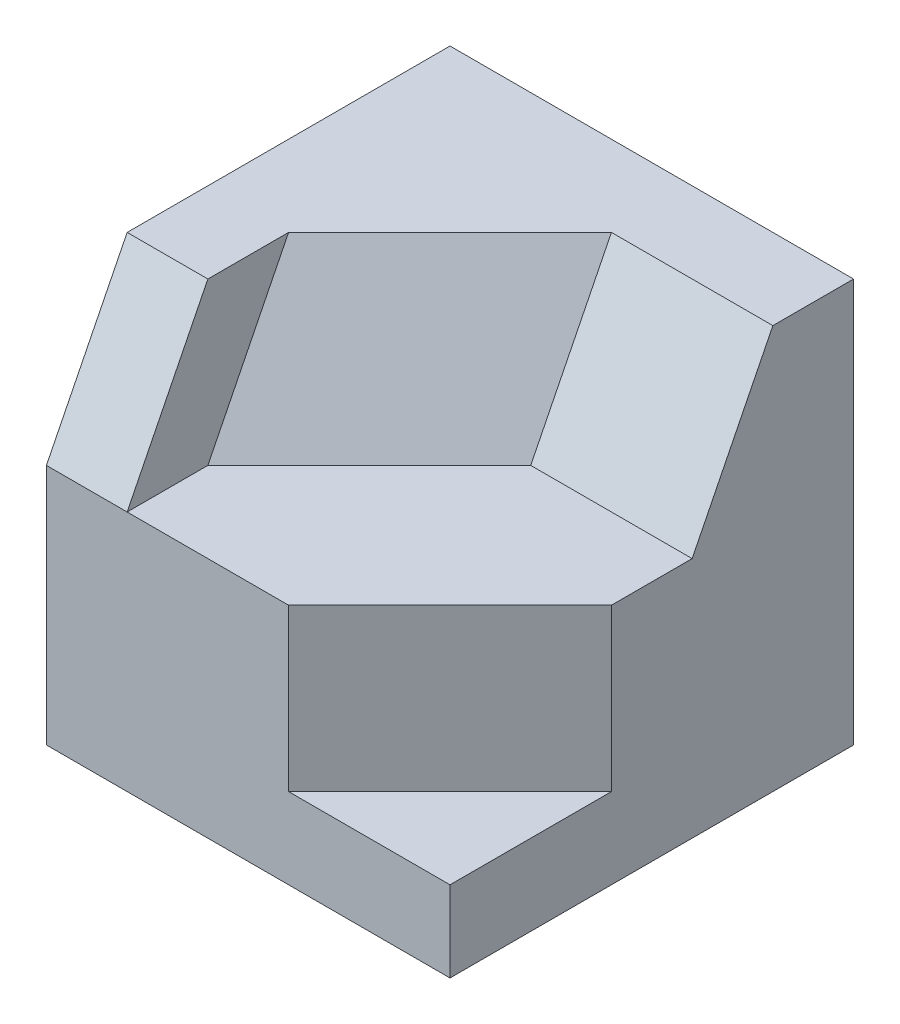
ISO-10303-21;
HEADER;
FILE_DESCRIPTION(('STEP AP214'),'2;1');
FILE_NAME('part.step','',(''),(''),'','','');
FILE_SCHEMA(('AUTOMOTIVE_DESIGN { 1 0 10303 214 1 1 1 1 }'));
ENDSEC;
DATA;
#1=APPLICATION_CONTEXT('core data for automotive mechanical design processes');
#2=APPLICATION_PROTOCOL_DEFINITION('international standard','automotive_design',2000,#1);
#3=PRODUCT_CONTEXT('',#1,'mechanical');
#4=PRODUCT('Part','Part','',(#3));
#5=PRODUCT_RELATED_PRODUCT_CATEGORY('part','',(#4));
#6=PRODUCT_DEFINITION_FORMATION('','',#4);
#7=PRODUCT_DEFINITION_CONTEXT('part definition',#1,'design');
#8=PRODUCT_DEFINITION('design','',#6,#7);
#9=PRODUCT_DEFINITION_SHAPE('','',#8);
#10=(LENGTH_UNIT() NAMED_UNIT(*) SI_UNIT(.MILLI.,.METRE.));
#11=(NAMED_UNIT(*) PLANE_ANGLE_UNIT() SI_UNIT($,.RADIAN.));
#12=(NAMED_UNIT(*) SI_UNIT($,.STERADIAN.) SOLID_ANGLE_UNIT());
#13=UNCERTAINTY_MEASURE_WITH_UNIT(LENGTH_MEASURE(1.E-05),#10,'distance_accuracy_value','');
#14=(GEOMETRIC_REPRESENTATION_CONTEXT(3) GLOBAL_UNCERTAINTY_ASSIGNED_CONTEXT((#13)) GLOBAL_UNIT_ASSIGNED_CONTEXT((#10,
#11,#12)) REPRESENTATION_CONTEXT('',''));
#15=CARTESIAN_POINT('',(0.,0.,0.));
#16=DIRECTION('',(0.,0.,1.));
#17=DIRECTION('',(1.,0.,0.));
#18=AXIS2_PLACEMENT_3D('',#15,#16,#17);
#19=CARTESIAN_POINT('',(2.5,2.5,5.));
#20=DIRECTION('',(0.,-1.,0.));
#21=DIRECTION('',(1.,0.,0.));
#22=AXIS2_PLACEMENT_3D('',#19,#20,#21);
#23=PLANE('',#22);
#24=DIRECTION('',(0.,0.,1.));
#25=VECTOR('',#24,1.);
#26=CARTESIAN_POINT('',(-1.5,2.5,4.));
#27=LINE('',#26,#25);
#28=CARTESIAN_POINT('',(-1.5,2.5,3.));
#29=VERTEX_POINT('',#28);
#30=CARTESIAN_POINT('',(-1.5,2.5,4.));
#31=VERTEX_POINT('',#30);
#32=EDGE_CURVE('E171',#29,#31,#27,.T.);
#33=ORIENTED_EDGE('',*,*,#32,.F.);
#34=DIRECTION('',(-0.707106781186547,0.,0.707106781186548));
#35=VECTOR('',#34,1.);
#36=CARTESIAN_POINT('',(0.750000000000001,2.5,0.75));
#37=LINE('',#36,#35);
#38=CARTESIAN_POINT('',(0.500000000000001,2.5,1.));
#39=VERTEX_POINT('',#38);
#40=EDGE_CURVE('E162',#39,#29,#37,.T.);
#41=ORIENTED_EDGE('',*,*,#40,.F.);
#42=DIRECTION('',(1.,0.,0.));
#43=VECTOR('',#42,1.);
#44=CARTESIAN_POINT('',(0.5,2.5,1.));
#45=LINE('',#44,#43);
#46=CARTESIAN_POINT('',(2.5,2.5,1.));
#47=VERTEX_POINT('',#46);
#48=EDGE_CURVE('E148',#39,#47,#45,.T.);
#49=ORIENTED_EDGE('',*,*,#48,.T.);
#50=DIRECTION('',(0.,0.,-1.));
#51=VECTOR('',#50,1.);
#52=CARTESIAN_POINT('',(2.5,2.5,5.));
#53=LINE('',#52,#51);
#54=CARTESIAN_POINT('',(2.5,2.5,0.));
#55=VERTEX_POINT('',#54);
#56=EDGE_CURVE('E88',#47,#55,#53,.T.);
#57=ORIENTED_EDGE('',*,*,#56,.T.);
#58=DIRECTION('',(-1.,0.,0.));
#59=VECTOR('',#58,1.);
#60=CARTESIAN_POINT('',(2.5,2.5,0.));
#61=LINE('',#60,#59);
#62=CARTESIAN_POINT('',(-2.5,2.5,0.));
#63=VERTEX_POINT('',#62);
#64=EDGE_CURVE('E92',#55,#63,#61,.T.);
#65=ORIENTED_EDGE('',*,*,#64,.T.);
#66=DIRECTION('',(0.,0.,-1.));
#67=VECTOR('',#66,1.);
#68=CARTESIAN_POINT('',(-2.5,2.5,5.));
#69=LINE('',#68,#67);
#70=CARTESIAN_POINT('',(-2.5,2.5,4.));
#71=VERTEX_POINT('',#70);
#72=EDGE_CURVE('E77',#71,#63,#69,.T.);
#73=ORIENTED_EDGE('',*,*,#72,.F.);
#74=DIRECTION('',(-1.,0.,0.));
#75=VECTOR('',#74,1.);
#76=CARTESIAN_POINT('',(-1.5,2.5,4.));
#77=LINE('',#76,#75);
#78=EDGE_CURVE('E134',#31,#71,#77,.T.);
#79=ORIENTED_EDGE('',*,*,#78,.F.);
#80=EDGE_LOOP('',(#33,#41,#49,#57,#65,#73,#79));
#81=FACE_BOUND('',#80,.T.);
#82=ADVANCED_FACE('F33',(#81),#23,.F.);
#83=CARTESIAN_POINT('',(-2.5,-2.5,5.));
#84=DIRECTION('',(1.,0.,0.));
#85=DIRECTION('',(0.,0.,-1.));
#86=AXIS2_PLACEMENT_3D('',#83,#84,#85);
#87=PLANE('',#86);
#88=DIRECTION('',(0.,-1.,0.));
#89=VECTOR('',#88,1.);
#90=CARTESIAN_POINT('',(-2.5,-2.5,5.));
#91=LINE('',#90,#89);
#92=CARTESIAN_POINT('',(-2.5,0.5,5.));
#93=VERTEX_POINT('',#92);
#94=CARTESIAN_POINT('',(-2.5,-2.5,5.));
#95=VERTEX_POINT('',#94);
#96=EDGE_CURVE('E99',#93,#95,#91,.T.);
#97=ORIENTED_EDGE('',*,*,#96,.F.);
#98=DIRECTION('',(0.,-0.894427190999916,0.447213595499958));
#99=VECTOR('',#98,1.);
#100=CARTESIAN_POINT('',(-2.5,2.5,4.));
#101=LINE('',#100,#99);
#102=EDGE_CURVE('E85',#71,#93,#101,.T.);
#103=ORIENTED_EDGE('',*,*,#102,.F.);
#104=ORIENTED_EDGE('',*,*,#72,.T.);
#105=DIRECTION('',(0.,-1.,0.));
#106=VECTOR('',#105,1.);
#107=CARTESIAN_POINT('',(-2.5,-2.5,0.));
#108=LINE('',#107,#106);
#109=CARTESIAN_POINT('',(-2.5,-2.5,0.));
#110=VERTEX_POINT('',#109);
#111=EDGE_CURVE('E82',#63,#110,#108,.T.);
#112=ORIENTED_EDGE('',*,*,#111,.T.);
#113=DIRECTION('',(0.,0.,-1.));
#114=VECTOR('',#113,1.);
#115=CARTESIAN_POINT('',(-2.5,-2.5,5.));
#116=LINE('',#115,#114);
#117=EDGE_CURVE('E41',#95,#110,#116,.T.);
#118=ORIENTED_EDGE('',*,*,#117,.F.);
#119=EDGE_LOOP('',(#97,#103,#104,#112,#118));
#120=FACE_BOUND('',#119,.T.);
#121=ADVANCED_FACE('F35',(#120),#87,.F.);
#122=CARTESIAN_POINT('',(2.5,-2.5,5.));
#123=DIRECTION('',(0.,1.,0.));
#124=DIRECTION('',(0.,0.,1.));
#125=AXIS2_PLACEMENT_3D('',#122,#123,#124);
#126=PLANE('',#125);
#127=DIRECTION('',(1.,0.,0.));
#128=VECTOR('',#127,1.);
#129=CARTESIAN_POINT('',(2.5,-2.5,0.));
#130=LINE('',#129,#128);
#131=CARTESIAN_POINT('',(2.5,-2.5,0.));
#132=VERTEX_POINT('',#131);
#133=EDGE_CURVE('E103',#110,#132,#130,.T.);
#134=ORIENTED_EDGE('',*,*,#133,.T.);
#135=DIRECTION('',(0.,0.,-1.));
#136=VECTOR('',#135,1.);
#137=CARTESIAN_POINT('',(2.5,-2.5,5.));
#138=LINE('',#137,#136);
#139=CARTESIAN_POINT('',(2.5,-2.5,5.));
#140=VERTEX_POINT('',#139);
#141=EDGE_CURVE('E116',#140,#132,#138,.T.);
#142=ORIENTED_EDGE('',*,*,#141,.F.);
#143=DIRECTION('',(1.,0.,0.));
#144=VECTOR('',#143,1.);
#145=CARTESIAN_POINT('',(2.5,-2.5,5.));
#146=LINE('',#145,#144);
#147=EDGE_CURVE('E57',#95,#140,#146,.T.);
#148=ORIENTED_EDGE('',*,*,#147,.F.);
#149=ORIENTED_EDGE('',*,*,#117,.T.);
#150=EDGE_LOOP('',(#134,#142,#148,#149));
#151=FACE_BOUND('',#150,.T.);
#152=ADVANCED_FACE('F119',(#151),#126,.F.);
#153=CARTESIAN_POINT('',(2.5,-2.5,5.));
#154=DIRECTION('',(-1.,0.,0.));
#155=DIRECTION('',(0.,0.,1.));
#156=AXIS2_PLACEMENT_3D('',#153,#154,#155);
#157=PLANE('',#156);
#158=ORIENTED_EDGE('',*,*,#56,.F.);
#159=DIRECTION('',(0.,0.894427190999916,-0.447213595499958));
#160=VECTOR('',#159,1.);
#161=CARTESIAN_POINT('',(2.5,2.5,1.));
#162=LINE('',#161,#160);
#163=CARTESIAN_POINT('',(2.5,0.5,2.));
#164=VERTEX_POINT('',#163);
#165=EDGE_CURVE('E151',#164,#47,#162,.T.);
#166=ORIENTED_EDGE('',*,*,#165,.F.);
#167=DIRECTION('',(0.,0.,1.));
#168=VECTOR('',#167,1.);
#169=CARTESIAN_POINT('',(2.5,0.5,2.));
#170=LINE('',#169,#168);
#171=CARTESIAN_POINT('',(2.5,0.5,3.));
#172=VERTEX_POINT('',#171);
#173=EDGE_CURVE('E140',#164,#172,#170,.T.);
#174=ORIENTED_EDGE('',*,*,#173,.T.);
#175=DIRECTION('',(0.,1.,0.));
#176=VECTOR('',#175,1.);
#177=CARTESIAN_POINT('',(2.5,-1.5,3.));
#178=LINE('',#177,#176);
#179=CARTESIAN_POINT('',(2.5,-1.5,3.));
#180=VERTEX_POINT('',#179);
#181=EDGE_CURVE('E109',#180,#172,#178,.T.);
#182=ORIENTED_EDGE('',*,*,#181,.F.);
#183=DIRECTION('',(0.,0.,-1.));
#184=VECTOR('',#183,1.);
#185=CARTESIAN_POINT('',(2.5,-1.5,5.));
#186=LINE('',#185,#184);
#187=CARTESIAN_POINT('',(2.5,-1.5,5.));
#188=VERTEX_POINT('',#187);
#189=EDGE_CURVE('E129',#188,#180,#186,.T.);
#190=ORIENTED_EDGE('',*,*,#189,.F.);
#191=DIRECTION('',(0.,1.,0.));
#192=VECTOR('',#191,1.);
#193=CARTESIAN_POINT('',(2.5,-2.5,5.));
#194=LINE('',#193,#192);
#195=EDGE_CURVE('E89',#140,#188,#194,.T.);
#196=ORIENTED_EDGE('',*,*,#195,.F.);
#197=ORIENTED_EDGE('',*,*,#141,.T.);
#198=DIRECTION('',(0.,1.,0.));
#199=VECTOR('',#198,1.);
#200=CARTESIAN_POINT('',(2.5,-2.5,0.));
#201=LINE('',#200,#199);
#202=EDGE_CURVE('E100',#132,#55,#201,.T.);
#203=ORIENTED_EDGE('',*,*,#202,.T.);
#204=EDGE_LOOP('',(#158,#166,#174,#182,#190,#196,#197,#203));
#205=FACE_BOUND('',#204,.T.);
#206=ADVANCED_FACE('F208',(#205),#157,.F.);
#207=CARTESIAN_POINT('',(0.,0.,5.));
#208=DIRECTION('',(0.,0.,1.));
#209=DIRECTION('',(1.,0.,0.));
#210=AXIS2_PLACEMENT_3D('',#207,#208,#209);
#211=PLANE('',#210);
#212=DIRECTION('',(1.,0.,0.));
#213=VECTOR('',#212,1.);
#214=CARTESIAN_POINT('',(-1.5,0.5,5.));
#215=LINE('',#214,#213);
#216=CARTESIAN_POINT('',(-1.5,0.5,5.));
#217=VERTEX_POINT('',#216);
#218=CARTESIAN_POINT('',(0.500000000000001,0.5,5.));
#219=VERTEX_POINT('',#218);
#220=EDGE_CURVE('E154',#217,#219,#215,.T.);
#221=ORIENTED_EDGE('',*,*,#220,.F.);
#222=DIRECTION('',(-1.,0.,0.));
#223=VECTOR('',#222,1.);
#224=CARTESIAN_POINT('',(-1.5,0.5,5.));
#225=LINE('',#224,#223);
#226=EDGE_CURVE('E133',#217,#93,#225,.T.);
#227=ORIENTED_EDGE('',*,*,#226,.T.);
#228=ORIENTED_EDGE('',*,*,#96,.T.);
#229=ORIENTED_EDGE('',*,*,#147,.T.);
#230=ORIENTED_EDGE('',*,*,#195,.T.);
#231=DIRECTION('',(1.,0.,0.));
#232=VECTOR('',#231,1.);
#233=CARTESIAN_POINT('',(0.500000000000001,-1.5,5.));
#234=LINE('',#233,#232);
#235=CARTESIAN_POINT('',(0.500000000000001,-1.5,5.));
#236=VERTEX_POINT('',#235);
#237=EDGE_CURVE('E131',#236,#188,#234,.T.);
#238=ORIENTED_EDGE('',*,*,#237,.F.);
#239=DIRECTION('',(0.,1.,0.));
#240=VECTOR('',#239,1.);
#241=CARTESIAN_POINT('',(0.500000000000001,-1.5,5.));
#242=LINE('',#241,#240);
#243=EDGE_CURVE('E105',#236,#219,#242,.T.);
#244=ORIENTED_EDGE('',*,*,#243,.T.);
#245=EDGE_LOOP('',(#221,#227,#228,#229,#230,#238,#244));
#246=FACE_BOUND('',#245,.T.);
#247=ADVANCED_FACE('F191',(#246),#211,.T.);
#248=CARTESIAN_POINT('',(0.,0.,0.));
#249=DIRECTION('',(0.,0.,1.));
#250=DIRECTION('',(1.,0.,0.));
#251=AXIS2_PLACEMENT_3D('',#248,#249,#250);
#252=PLANE('',#251);
#253=ORIENTED_EDGE('',*,*,#111,.F.);
#254=ORIENTED_EDGE('',*,*,#64,.F.);
#255=ORIENTED_EDGE('',*,*,#202,.F.);
#256=ORIENTED_EDGE('',*,*,#133,.F.);
#257=EDGE_LOOP('',(#253,#254,#255,#256));
#258=FACE_BOUND('',#257,.T.);
#259=ADVANCED_FACE('F102',(#258),#252,.F.);
#260=CARTESIAN_POINT('',(2.5,-1.5,3.));
#261=DIRECTION('',(-0.707106781186547,0.,-0.707106781186547));
#262=DIRECTION('',(-0.707106781186548,0.,0.707106781186548));
#263=AXIS2_PLACEMENT_3D('',#260,#261,#262);
#264=PLANE('',#263);
#265=ORIENTED_EDGE('',*,*,#181,.T.);
#266=DIRECTION('',(-0.707106781186548,0.,0.707106781186548));
#267=VECTOR('',#266,1.);
#268=CARTESIAN_POINT('',(2.5,0.5,3.));
#269=LINE('',#268,#267);
#270=EDGE_CURVE('E11',#172,#219,#269,.T.);
#271=ORIENTED_EDGE('',*,*,#270,.T.);
#272=ORIENTED_EDGE('',*,*,#243,.F.);
#273=DIRECTION('',(-0.707106781186548,0.,0.707106781186548));
#274=VECTOR('',#273,1.);
#275=CARTESIAN_POINT('',(2.5,-1.5,3.));
#276=LINE('',#275,#274);
#277=EDGE_CURVE('E48',#180,#236,#276,.T.);
#278=ORIENTED_EDGE('',*,*,#277,.F.);
#279=EDGE_LOOP('',(#265,#271,#272,#278));
#280=FACE_BOUND('',#279,.T.);
#281=ADVANCED_FACE('F203',(#280),#264,.F.);
#282=CARTESIAN_POINT('',(0.,-1.5,0.));
#283=DIRECTION('',(0.,1.,0.));
#284=DIRECTION('',(-1.,0.,0.));
#285=AXIS2_PLACEMENT_3D('',#282,#283,#284);
#286=PLANE('',#285);
#287=ORIENTED_EDGE('',*,*,#237,.T.);
#288=ORIENTED_EDGE('',*,*,#189,.T.);
#289=ORIENTED_EDGE('',*,*,#277,.T.);
#290=EDGE_LOOP('',(#287,#288,#289));
#291=FACE_BOUND('',#290,.T.);
#292=ADVANCED_FACE('F227',(#291),#286,.T.);
#293=CARTESIAN_POINT('',(-1.5,2.5,4.));
#294=DIRECTION('',(0.,-0.447213595499958,-0.894427190999916));
#295=DIRECTION('',(0.,0.894427190999916,-0.447213595499958));
#296=AXIS2_PLACEMENT_3D('',#293,#294,#295);
#297=PLANE('',#296);
#298=ORIENTED_EDGE('',*,*,#102,.T.);
#299=ORIENTED_EDGE('',*,*,#226,.F.);
#300=DIRECTION('',(0.,-0.894427190999916,0.447213595499958));
#301=VECTOR('',#300,1.);
#302=CARTESIAN_POINT('',(-1.5,2.5,4.));
#303=LINE('',#302,#301);
#304=EDGE_CURVE('E137',#31,#217,#303,.T.);
#305=ORIENTED_EDGE('',*,*,#304,.F.);
#306=ORIENTED_EDGE('',*,*,#78,.T.);
#307=EDGE_LOOP('',(#298,#299,#305,#306));
#308=FACE_BOUND('',#307,.T.);
#309=ADVANCED_FACE('F186',(#308),#297,.F.);
#310=CARTESIAN_POINT('',(0.500000000000001,0.5,2.));
#311=DIRECTION('',(0.,-1.,0.));
#312=DIRECTION('',(0.,0.,-1.));
#313=AXIS2_PLACEMENT_3D('',#310,#311,#312);
#314=PLANE('',#313);
#315=ORIENTED_EDGE('',*,*,#173,.F.);
#316=DIRECTION('',(1.,0.,0.));
#317=VECTOR('',#316,1.);
#318=CARTESIAN_POINT('',(0.500000000000001,0.5,2.));
#319=LINE('',#318,#317);
#320=CARTESIAN_POINT('',(0.500000000000001,0.5,2.));
#321=VERTEX_POINT('',#320);
#322=EDGE_CURVE('E145',#321,#164,#319,.T.);
#323=ORIENTED_EDGE('',*,*,#322,.F.);
#324=DIRECTION('',(0.707106781186547,0.,-0.707106781186548));
#325=VECTOR('',#324,1.);
#326=CARTESIAN_POINT('',(1.25,0.500000000000002,1.25));
#327=LINE('',#326,#325);
#328=CARTESIAN_POINT('',(-1.5,0.499999999999999,4.));
#329=VERTEX_POINT('',#328);
#330=EDGE_CURVE('E168',#329,#321,#327,.T.);
#331=ORIENTED_EDGE('',*,*,#330,.F.);
#332=DIRECTION('',(0.,0.,-1.));
#333=VECTOR('',#332,1.);
#334=CARTESIAN_POINT('',(-1.5,0.499999999999999,4.));
#335=LINE('',#334,#333);
#336=EDGE_CURVE('E159',#217,#329,#335,.T.);
#337=ORIENTED_EDGE('',*,*,#336,.F.);
#338=ORIENTED_EDGE('',*,*,#220,.T.);
#339=ORIENTED_EDGE('',*,*,#270,.F.);
#340=EDGE_LOOP('',(#315,#323,#331,#337,#338,#339));
#341=FACE_BOUND('',#340,.T.);
#342=ADVANCED_FACE('F197',(#341),#314,.F.);
#343=CARTESIAN_POINT('',(0.5,2.5,1.));
#344=DIRECTION('',(0.,-0.447213595499958,-0.894427190999916));
#345=DIRECTION('',(0.,0.894427190999916,-0.447213595499958));
#346=AXIS2_PLACEMENT_3D('',#343,#344,#345);
#347=PLANE('',#346);
#348=ORIENTED_EDGE('',*,*,#165,.T.);
#349=ORIENTED_EDGE('',*,*,#48,.F.);
#350=DIRECTION('',(0.,0.894427190999916,-0.447213595499958));
#351=VECTOR('',#350,1.);
#352=CARTESIAN_POINT('',(0.5,2.5,1.));
#353=LINE('',#352,#351);
#354=EDGE_CURVE('E150',#321,#39,#353,.T.);
#355=ORIENTED_EDGE('',*,*,#354,.F.);
#356=ORIENTED_EDGE('',*,*,#322,.T.);
#357=EDGE_LOOP('',(#348,#349,#355,#356));
#358=FACE_BOUND('',#357,.T.);
#359=ADVANCED_FACE('F226',(#358),#347,.F.);
#360=CARTESIAN_POINT('',(-1.5,0.,0.));
#361=DIRECTION('',(-1.,0.,0.));
#362=DIRECTION('',(0.,-1.,0.));
#363=AXIS2_PLACEMENT_3D('',#360,#361,#362);
#364=PLANE('',#363);
#365=ORIENTED_EDGE('',*,*,#336,.T.);
#366=DIRECTION('',(0.,-0.894427190999916,0.447213595499958));
#367=VECTOR('',#366,1.);
#368=CARTESIAN_POINT('',(-1.5,1.7,3.4));
#369=LINE('',#368,#367);
#370=EDGE_CURVE('E165',#29,#329,#369,.T.);
#371=ORIENTED_EDGE('',*,*,#370,.F.);
#372=ORIENTED_EDGE('',*,*,#32,.T.);
#373=ORIENTED_EDGE('',*,*,#304,.T.);
#374=EDGE_LOOP('',(#365,#371,#372,#373));
#375=FACE_BOUND('',#374,.T.);
#376=ADVANCED_FACE('F177',(#375),#364,.F.);
#377=CARTESIAN_POINT('',(1.22222222222222,0.611111111111111,1.22222222222222));
#378=DIRECTION('',(-0.666666666666667,-0.333333333333333,-0.666666666666667));
#379=DIRECTION('',(-0.707106781186547,0.,0.707106781186548));
#380=AXIS2_PLACEMENT_3D('',#377,#378,#379);
#381=PLANE('',#380);
#382=ORIENTED_EDGE('',*,*,#330,.T.);
#383=ORIENTED_EDGE('',*,*,#354,.T.);
#384=ORIENTED_EDGE('',*,*,#40,.T.);
#385=ORIENTED_EDGE('',*,*,#370,.T.);
#386=EDGE_LOOP('',(#382,#383,#384,#385));
#387=FACE_BOUND('',#386,.T.);
#388=ADVANCED_FACE('F222',(#387),#381,.F.);
#389=CLOSED_SHELL('',(#82,#121,#152,#206,#247,#259,#281,#292,#309,#342,#359,#376,#388));
#390=MANIFOLD_SOLID_BREP('B2',#389);
#391=ADVANCED_BREP_SHAPE_REPRESENTATION('',(#18,#390),#14);
#392=SHAPE_DEFINITION_REPRESENTATION(#9,#391);
ENDSEC;
END-ISO-10303-21;
